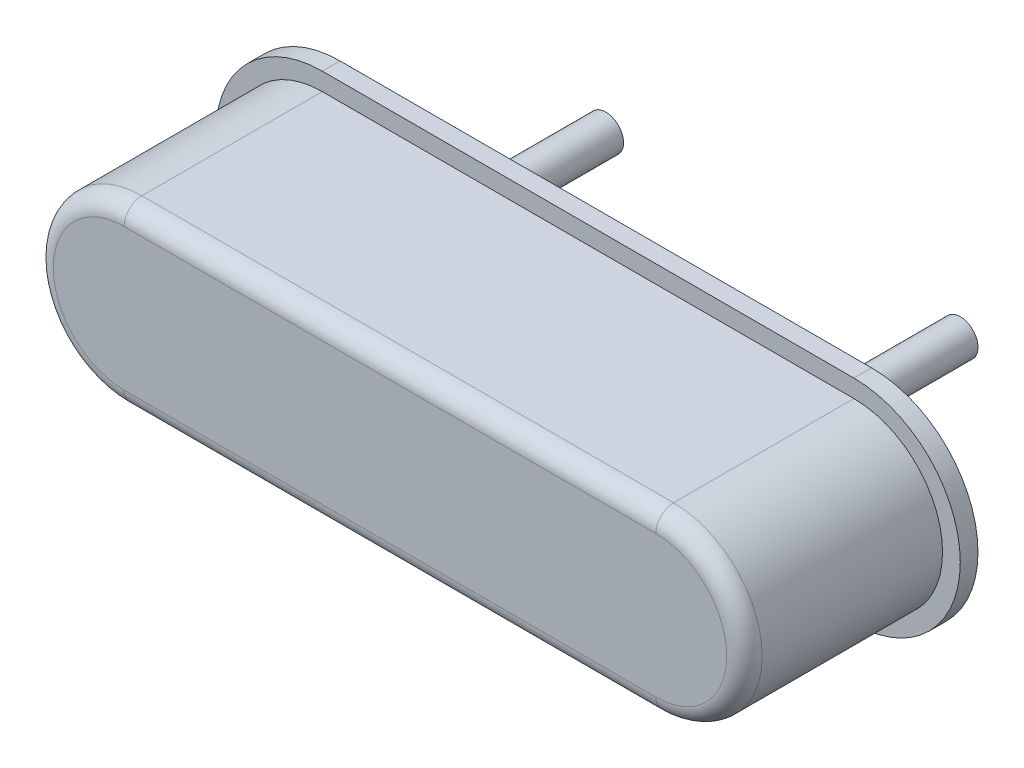
ISO-10303-21;
HEADER;
FILE_DESCRIPTION(('STEP AP214'),'2;1');
FILE_NAME('part.step','',(''),(''),'','','');
FILE_SCHEMA(('AUTOMOTIVE_DESIGN { 1 0 10303 214 1 1 1 1 }'));
ENDSEC;
DATA;
#1=APPLICATION_CONTEXT('core data for automotive mechanical design processes');
#2=APPLICATION_PROTOCOL_DEFINITION('international standard','automotive_design',2000,#1);
#3=PRODUCT_CONTEXT('',#1,'mechanical');
#4=PRODUCT('Part','Part','',(#3));
#5=PRODUCT_RELATED_PRODUCT_CATEGORY('part','',(#4));
#6=PRODUCT_DEFINITION_FORMATION('','',#4);
#7=PRODUCT_DEFINITION_CONTEXT('part definition',#1,'design');
#8=PRODUCT_DEFINITION('design','',#6,#7);
#9=PRODUCT_DEFINITION_SHAPE('','',#8);
#10=(LENGTH_UNIT() NAMED_UNIT(*) SI_UNIT(.MILLI.,.METRE.));
#11=(NAMED_UNIT(*) PLANE_ANGLE_UNIT() SI_UNIT($,.RADIAN.));
#12=(NAMED_UNIT(*) SI_UNIT($,.STERADIAN.) SOLID_ANGLE_UNIT());
#13=UNCERTAINTY_MEASURE_WITH_UNIT(LENGTH_MEASURE(1.E-05),#10,'distance_accuracy_value','');
#14=(GEOMETRIC_REPRESENTATION_CONTEXT(3) GLOBAL_UNCERTAINTY_ASSIGNED_CONTEXT((#13)) GLOBAL_UNIT_ASSIGNED_CONTEXT((#10,
#11,#12)) REPRESENTATION_CONTEXT('',''));
#15=CARTESIAN_POINT('',(0.,0.,0.));
#16=DIRECTION('',(0.,0.,1.));
#17=DIRECTION('',(1.,0.,0.));
#18=AXIS2_PLACEMENT_3D('',#15,#16,#17);
#19=CARTESIAN_POINT('',(7.62,1.27,3.09361477877701));
#20=DIRECTION('',(0.,0.,1.));
#21=DIRECTION('',(1.,0.,0.));
#22=AXIS2_PLACEMENT_3D('',#19,#20,#21);
#23=PLANE('',#22);
#24=DIRECTION('',(1.,0.,0.));
#25=VECTOR('',#24,1.);
#26=CARTESIAN_POINT('',(-2.54,-1.016,3.09361477877701));
#27=LINE('',#26,#25);
#28=CARTESIAN_POINT('',(6.35,-1.016,3.09361477877701));
#29=VERTEX_POINT('',#28);
#30=CARTESIAN_POINT('',(-1.27,-1.016,3.09361477877701));
#31=VERTEX_POINT('',#30);
#32=EDGE_CURVE('E175',#29,#31,#27,.F.);
#33=ORIENTED_EDGE('',*,*,#32,.F.);
#34=CARTESIAN_POINT('',(7.366,0.,3.09361477877701));
#35=CARTESIAN_POINT('',(7.3660003526422,-0.0166242779130649,3.09361477877701));
#36=CARTESIAN_POINT('',(7.36559199179916,-0.0332485258197346,3.09361477877701));
#37=CARTESIAN_POINT('',(7.36396037520976,-0.0664569884135803,3.09361477877701));
#38=CARTESIAN_POINT('',(7.36273711946339,-0.0830412031007561,3.09361477877701));
#39=CARTESIAN_POINT('',(7.35947824513451,-0.116129626048911,3.09361477877701));
#40=CARTESIAN_POINT('',(7.35744262655198,-0.132633834309891,3.09361477877701));
#41=CARTESIAN_POINT('',(7.35256404169645,-0.165522489783404,3.09361477877701));
#42=CARTESIAN_POINT('',(7.34972107542345,-0.181906936995939,3.09361477877701));
#43=CARTESIAN_POINT('',(7.34323461435591,-0.214516597340835,3.09361477877701));
#44=CARTESIAN_POINT('',(7.33959111956137,-0.230741810473197,3.09361477877701));
#45=CARTESIAN_POINT('',(7.33151238692994,-0.262993915090238,3.09361477877701));
#46=CARTESIAN_POINT('',(7.32707714909304,-0.279020806574916,3.09361477877701));
#47=CARTESIAN_POINT('',(7.3174256131148,-0.310837657606154,3.09361477877701));
#48=CARTESIAN_POINT('',(7.31220931497346,-0.326627617152714,3.09361477877701));
#49=CARTESIAN_POINT('',(7.30100822547844,-0.35793256494028,3.09361477877701));
#50=CARTESIAN_POINT('',(7.29502343412478,-0.373447553181286,3.09361477877701));
#51=CARTESIAN_POINT('',(7.28229977593816,-0.404165181384578,3.09361477877701));
#52=CARTESIAN_POINT('',(7.27556090910521,-0.419367821346863,3.09361477877701));
#53=CARTESIAN_POINT('',(7.26134533452163,-0.449424128503471,3.09361477877701));
#54=CARTESIAN_POINT('',(7.25386862677099,-0.464277795697793,3.09361477877701));
#55=CARTESIAN_POINT('',(7.23819538238487,-0.493600373532635,3.09361477877701));
#56=CARTESIAN_POINT('',(7.22999884574937,-0.508069284173154,3.09361477877701));
#57=CARTESIAN_POINT('',(7.21290568977118,-0.536587492027474,3.09361477877701));
#58=CARTESIAN_POINT('',(7.20400907042847,-0.550636789241274,3.09361477877701));
#59=CARTESIAN_POINT('',(7.1855371817703,-0.578281924254558,3.09361477877701));
#60=CARTESIAN_POINT('',(7.17596191245483,-0.59187776205404,3.09361477877701));
#61=CARTESIAN_POINT('',(7.15615579151383,-0.618583224674585,3.09361477877701));
#62=CARTESIAN_POINT('',(7.1459249398883,-0.631692849495647,3.09361477877701));
#63=CARTESIAN_POINT('',(7.12483230134478,-0.657394303924883,3.09361477877701));
#64=CARTESIAN_POINT('',(7.1139705144268,-0.669986133533058,3.09361477877701));
#65=CARTESIAN_POINT('',(7.09164217229447,-0.694621662716084,3.09361477877701));
#66=CARTESIAN_POINT('',(7.08017561708013,-0.706665362290935,3.09361477877701));
#67=CARTESIAN_POINT('',(7.05666536229093,-0.730175617080131,3.09361477877701));
#68=CARTESIAN_POINT('',(7.04462166271608,-0.741642172294476,3.09361477877701));
#69=CARTESIAN_POINT('',(7.01998613353306,-0.763970514426802,3.09361477877701));
#70=CARTESIAN_POINT('',(7.00739430392488,-0.774832301344783,3.09361477877701));
#71=CARTESIAN_POINT('',(6.98169284949564,-0.7959249398883,3.09361477877701));
#72=CARTESIAN_POINT('',(6.96858322467458,-0.806155791513836,3.09361477877701));
#73=CARTESIAN_POINT('',(6.94187776205404,-0.825961912454836,3.09361477877701));
#74=CARTESIAN_POINT('',(6.92828192425456,-0.835537181770301,3.09361477877701));
#75=CARTESIAN_POINT('',(6.90063678924127,-0.854009070428472,3.09361477877701));
#76=CARTESIAN_POINT('',(6.88658749202747,-0.862905689771178,3.09361477877701));
#77=CARTESIAN_POINT('',(6.85806928417315,-0.879998845749375,3.09361477877701));
#78=CARTESIAN_POINT('',(6.84360037353263,-0.888195382384866,3.09361477877701));
#79=CARTESIAN_POINT('',(6.81427779569779,-0.903868626770992,3.09361477877701));
#80=CARTESIAN_POINT('',(6.79942412850347,-0.911345334521627,3.09361477877701));
#81=CARTESIAN_POINT('',(6.76936782134686,-0.925560909105211,3.09361477877701));
#82=CARTESIAN_POINT('',(6.75416518138458,-0.93229977593816,3.09361477877701));
#83=CARTESIAN_POINT('',(6.72344755318128,-0.945023434124776,3.09361477877701));
#84=CARTESIAN_POINT('',(6.70793256494028,-0.951008225478442,3.09361477877701));
#85=CARTESIAN_POINT('',(6.67662761715271,-0.962209314973456,3.09361477877701));
#86=CARTESIAN_POINT('',(6.66083765760615,-0.967425613114804,3.09361477877701));
#87=CARTESIAN_POINT('',(6.62902080657491,-0.977077149093046,3.09361477877701));
#88=CARTESIAN_POINT('',(6.61299391509024,-0.98151238692994,3.09361477877701));
#89=CARTESIAN_POINT('',(6.5807418104732,-0.989591119561374,3.09361477877701));
#90=CARTESIAN_POINT('',(6.56451659734083,-0.993234614355912,3.09361477877701));
#91=CARTESIAN_POINT('',(6.53190693699594,-0.999721075423452,3.09361477877701));
#92=CARTESIAN_POINT('',(6.5155224897834,-1.00256404169645,3.09361477877701));
#93=CARTESIAN_POINT('',(6.48263383430989,-1.00744262655198,3.09361477877701));
#94=CARTESIAN_POINT('',(6.46612962604891,-1.00947824513451,3.09361477877701));
#95=CARTESIAN_POINT('',(6.43304120310075,-1.01273711946339,3.09361477877701));
#96=CARTESIAN_POINT('',(6.41645698841358,-1.01396037520975,3.09361477877701));
#97=CARTESIAN_POINT('',(6.38324852581973,-1.01559199179915,3.09361477877701));
#98=CARTESIAN_POINT('',(6.36662427791306,-1.0160003526422,3.09361477877701));
#99=CARTESIAN_POINT('',(6.35,-1.016,3.09361477877701));
#100=B_SPLINE_CURVE_WITH_KNOTS('',3,(#34,#35,#36,#37,#38,#39,#40,#41,#42,#43,#44,#45,#46,#47,
#48,#49,#50,#51,#52,#53,#54,#55,#56,#57,#58,#59,#60,#61,#62,#63,#64,#65,#66,#67,#68,#69,#70,#71,
#72,#73,#74,#75,#76,#77,#78,#79,#80,#81,#82,#83,#84,#85,#86,#87,#88,#89,#90,#91,#92,#93,#94,#95,
#96,#97,#98,#99),.UNSPECIFIED.,.F.,.F.,(4,2,2,2,2,2,2,2,2,2,2,2,2,2,2,2,2,2,2,2,2,2,2,2,2,2,2,2,
2,2,2,2,4),(0.,0.0498677763585586,0.0997355527171153,0.149603329075673,0.199471105434232,
0.24933888179279,0.299206658151348,0.349074434509905,0.398942210868463,0.448809987227021,
0.498677763585578,0.548545539944136,0.598413316302693,0.648281092661251,0.69814886901981,
0.748016645378367,0.797884421736925,0.847752198095483,0.897619974454041,0.947487750812599,
0.997355527171155,1.04722330352971,1.09709107988827,1.14695885624683,1.19682663260539,
1.24669440896394,1.2965621853225,1.34642996168106,1.39629773803962,1.44616551439818,
1.49603329075673,1.54590106711529,1.59576884347385),.UNSPECIFIED.);
#101=CARTESIAN_POINT('',(7.366,0.,3.09361477877701));
#102=VERTEX_POINT('',#101);
#103=EDGE_CURVE('E188',#102,#29,#100,.T.);
#104=ORIENTED_EDGE('',*,*,#103,.F.);
#105=CARTESIAN_POINT('',(6.35,0.,3.09361477877701));
#106=DIRECTION('',(0.,0.,-1.));
#107=DIRECTION('',(0.,1.,0.));
#108=AXIS2_PLACEMENT_3D('',#105,#106,#107);
#109=CIRCLE('',#108,1.016);
#110=CARTESIAN_POINT('',(6.35,1.016,3.09361477877701));
#111=VERTEX_POINT('',#110);
#112=EDGE_CURVE('E132',#111,#102,#109,.T.);
#113=ORIENTED_EDGE('',*,*,#112,.F.);
#114=DIRECTION('',(-1.,0.,0.));
#115=VECTOR('',#114,1.);
#116=CARTESIAN_POINT('',(7.62,1.016,3.09361477877701));
#117=LINE('',#116,#115);
#118=CARTESIAN_POINT('',(-1.27,1.016,3.09361477877701));
#119=VERTEX_POINT('',#118);
#120=EDGE_CURVE('E130',#119,#111,#117,.F.);
#121=ORIENTED_EDGE('',*,*,#120,.F.);
#122=CARTESIAN_POINT('',(-1.27,0.,3.09361477877701));
#123=DIRECTION('',(0.,0.,-1.));
#124=DIRECTION('',(-1.,0.,0.));
#125=AXIS2_PLACEMENT_3D('',#122,#123,#124);
#126=CIRCLE('',#125,1.016);
#127=CARTESIAN_POINT('',(-2.286,0.,3.09361477877701));
#128=VERTEX_POINT('',#127);
#129=EDGE_CURVE('E115',#119,#128,#126,.F.);
#130=ORIENTED_EDGE('',*,*,#129,.T.);
#131=CARTESIAN_POINT('',(-1.27,0.,3.09361477877701));
#132=DIRECTION('',(0.,0.,-1.));
#133=DIRECTION('',(0.,-1.,0.));
#134=AXIS2_PLACEMENT_3D('',#131,#132,#133);
#135=CIRCLE('',#134,1.016);
#136=EDGE_CURVE('E125',#31,#128,#135,.T.);
#137=ORIENTED_EDGE('',*,*,#136,.F.);
#138=EDGE_LOOP('',(#33,#104,#113,#121,#130,#137));
#139=FACE_BOUND('',#138,.T.);
#140=ADVANCED_FACE('F16',(#139),#23,.T.);
#141=CARTESIAN_POINT('',(-2.54,-1.016,2.83961477877701));
#142=DIRECTION('',(1.,0.,0.));
#143=DIRECTION('',(0.,0.,-1.));
#144=AXIS2_PLACEMENT_3D('',#141,#142,#143);
#145=CYLINDRICAL_SURFACE('',#144,0.254);
#146=CARTESIAN_POINT('',(6.35,-1.016,2.83961477877701));
#147=DIRECTION('',(1.,0.,0.));
#148=DIRECTION('',(0.,-1.,0.));
#149=AXIS2_PLACEMENT_3D('',#146,#147,#148);
#150=CIRCLE('',#149,0.254);
#151=CARTESIAN_POINT('',(6.35,-1.27,2.83961477877701));
#152=VERTEX_POINT('',#151);
#153=EDGE_CURVE('E159',#29,#152,#150,.T.);
#154=ORIENTED_EDGE('',*,*,#153,.F.);
#155=ORIENTED_EDGE('',*,*,#32,.T.);
#156=CARTESIAN_POINT('',(-1.27,-1.016,2.83961477877701));
#157=DIRECTION('',(1.,0.,0.));
#158=DIRECTION('',(0.,0.,-1.));
#159=AXIS2_PLACEMENT_3D('',#156,#157,#158);
#160=CIRCLE('',#159,0.254);
#161=CARTESIAN_POINT('',(-1.27,-1.27,2.83961477877701));
#162=VERTEX_POINT('',#161);
#163=EDGE_CURVE('E182',#31,#162,#160,.T.);
#164=ORIENTED_EDGE('',*,*,#163,.T.);
#165=DIRECTION('',(1.,0.,0.));
#166=VECTOR('',#165,1.);
#167=CARTESIAN_POINT('',(-2.54,-1.27,2.83961477877701));
#168=LINE('',#167,#166);
#169=EDGE_CURVE('E140',#162,#152,#168,.T.);
#170=ORIENTED_EDGE('',*,*,#169,.T.);
#171=EDGE_LOOP('',(#154,#155,#164,#170));
#172=FACE_BOUND('',#171,.T.);
#173=ADVANCED_FACE('F165',(#172),#145,.T.);
#174=CARTESIAN_POINT('',(6.35,0.,2.83961477877701));
#175=DIRECTION('',(0.,0.,1.));
#176=DIRECTION('',(1.,0.,0.));
#177=AXIS2_PLACEMENT_3D('',#174,#175,#176);
#178=TOROIDAL_SURFACE('',#177,1.016,0.254);
#179=CARTESIAN_POINT('',(6.35,1.016,2.83961477877701));
#180=DIRECTION('',(-1.,0.,0.));
#181=DIRECTION('',(0.,0.,1.));
#182=AXIS2_PLACEMENT_3D('',#179,#180,#181);
#183=CIRCLE('',#182,0.254);
#184=CARTESIAN_POINT('',(6.35,1.27,2.83961477877701));
#185=VERTEX_POINT('',#184);
#186=EDGE_CURVE('E135',#111,#185,#183,.T.);
#187=ORIENTED_EDGE('',*,*,#186,.F.);
#188=ORIENTED_EDGE('',*,*,#112,.T.);
#189=ORIENTED_EDGE('',*,*,#103,.T.);
#190=ORIENTED_EDGE('',*,*,#153,.T.);
#191=CARTESIAN_POINT('',(6.35,0.,2.83961477877701));
#192=DIRECTION('',(0.,0.,1.));
#193=DIRECTION('',(1.,0.,0.));
#194=AXIS2_PLACEMENT_3D('',#191,#192,#193);
#195=CIRCLE('',#194,1.27);
#196=EDGE_CURVE('E151',#185,#152,#195,.F.);
#197=ORIENTED_EDGE('',*,*,#196,.F.);
#198=EDGE_LOOP('',(#187,#188,#189,#190,#197));
#199=FACE_BOUND('',#198,.T.);
#200=ADVANCED_FACE('F161',(#199),#178,.T.);
#201=CARTESIAN_POINT('',(7.62,1.016,2.83961477877701));
#202=DIRECTION('',(-1.,0.,0.));
#203=DIRECTION('',(0.,0.,1.));
#204=AXIS2_PLACEMENT_3D('',#201,#202,#203);
#205=CYLINDRICAL_SURFACE('',#204,0.254);
#206=CARTESIAN_POINT('',(-1.27,1.016,2.83961477877701));
#207=DIRECTION('',(-1.,0.,0.));
#208=DIRECTION('',(0.,1.,0.));
#209=AXIS2_PLACEMENT_3D('',#206,#207,#208);
#210=CIRCLE('',#209,0.254);
#211=CARTESIAN_POINT('',(-1.27,1.27,2.83961477877701));
#212=VERTEX_POINT('',#211);
#213=EDGE_CURVE('E122',#119,#212,#210,.T.);
#214=ORIENTED_EDGE('',*,*,#213,.F.);
#215=ORIENTED_EDGE('',*,*,#120,.T.);
#216=ORIENTED_EDGE('',*,*,#186,.T.);
#217=DIRECTION('',(1.,0.,0.));
#218=VECTOR('',#217,1.);
#219=CARTESIAN_POINT('',(-2.54,1.27,2.83961477877701));
#220=LINE('',#219,#218);
#221=EDGE_CURVE('E88',#212,#185,#220,.T.);
#222=ORIENTED_EDGE('',*,*,#221,.F.);
#223=EDGE_LOOP('',(#214,#215,#216,#222));
#224=FACE_BOUND('',#223,.T.);
#225=ADVANCED_FACE('F137',(#224),#205,.T.);
#226=CARTESIAN_POINT('',(-1.27,0.,2.83961477877701));
#227=DIRECTION('',(0.,0.,1.));
#228=DIRECTION('',(1.,0.,0.));
#229=AXIS2_PLACEMENT_3D('',#226,#227,#228);
#230=TOROIDAL_SURFACE('',#229,1.016,0.254);
#231=ORIENTED_EDGE('',*,*,#213,.T.);
#232=CARTESIAN_POINT('',(-1.27,0.,2.83961477877701));
#233=DIRECTION('',(0.,0.,-1.));
#234=DIRECTION('',(-1.,0.,0.));
#235=AXIS2_PLACEMENT_3D('',#232,#233,#234);
#236=CIRCLE('',#235,1.27);
#237=EDGE_CURVE('E238',#162,#212,#236,.T.);
#238=ORIENTED_EDGE('',*,*,#237,.F.);
#239=ORIENTED_EDGE('',*,*,#163,.F.);
#240=ORIENTED_EDGE('',*,*,#136,.T.);
#241=ORIENTED_EDGE('',*,*,#129,.F.);
#242=EDGE_LOOP('',(#231,#238,#239,#240,#241));
#243=FACE_BOUND('',#242,.T.);
#244=ADVANCED_FACE('F121',(#243),#230,.T.);
#245=CARTESIAN_POINT('',(-2.54,-1.27,0.));
#246=DIRECTION('',(0.,1.,0.));
#247=DIRECTION('',(0.,0.,1.));
#248=AXIS2_PLACEMENT_3D('',#245,#246,#247);
#249=PLANE('',#248);
#250=DIRECTION('',(0.,0.,-1.));
#251=VECTOR('',#250,1.);
#252=CARTESIAN_POINT('',(6.35,-1.27,3.09361477877701));
#253=LINE('',#252,#251);
#254=CARTESIAN_POINT('',(6.35,-1.27,0.254));
#255=VERTEX_POINT('',#254);
#256=EDGE_CURVE('E154',#152,#255,#253,.T.);
#257=ORIENTED_EDGE('',*,*,#256,.F.);
#258=ORIENTED_EDGE('',*,*,#169,.F.);
#259=DIRECTION('',(0.,0.,1.));
#260=VECTOR('',#259,1.);
#261=CARTESIAN_POINT('',(-1.27,-1.27,0.));
#262=LINE('',#261,#260);
#263=CARTESIAN_POINT('',(-1.27,-1.27,0.254));
#264=VERTEX_POINT('',#263);
#265=EDGE_CURVE('E138',#264,#162,#262,.T.);
#266=ORIENTED_EDGE('',*,*,#265,.F.);
#267=DIRECTION('',(-1.,0.,0.));
#268=VECTOR('',#267,1.);
#269=CARTESIAN_POINT('',(6.35,-1.27,0.254));
#270=LINE('',#269,#268);
#271=EDGE_CURVE('E245',#264,#255,#270,.F.);
#272=ORIENTED_EDGE('',*,*,#271,.T.);
#273=EDGE_LOOP('',(#257,#258,#266,#272));
#274=FACE_BOUND('',#273,.T.);
#275=ADVANCED_FACE('F252',(#274),#249,.F.);
#276=CARTESIAN_POINT('',(6.35,0.,0.));
#277=DIRECTION('',(0.,0.,1.));
#278=DIRECTION('',(1.,0.,0.));
#279=AXIS2_PLACEMENT_3D('',#276,#277,#278);
#280=CYLINDRICAL_SURFACE('',#279,1.27);
#281=DIRECTION('',(0.,0.,1.));
#282=VECTOR('',#281,1.);
#283=CARTESIAN_POINT('',(6.35,1.27,0.));
#284=LINE('',#283,#282);
#285=CARTESIAN_POINT('',(6.35,1.27,0.254));
#286=VERTEX_POINT('',#285);
#287=EDGE_CURVE('E153',#185,#286,#284,.F.);
#288=ORIENTED_EDGE('',*,*,#287,.F.);
#289=ORIENTED_EDGE('',*,*,#196,.T.);
#290=ORIENTED_EDGE('',*,*,#256,.T.);
#291=CARTESIAN_POINT('',(6.35,0.,0.254));
#292=DIRECTION('',(0.,0.,1.));
#293=DIRECTION('',(1.,0.,0.));
#294=AXIS2_PLACEMENT_3D('',#291,#292,#293);
#295=CIRCLE('',#294,1.27);
#296=EDGE_CURVE('E71',#255,#286,#295,.T.);
#297=ORIENTED_EDGE('',*,*,#296,.T.);
#298=EDGE_LOOP('',(#288,#289,#290,#297));
#299=FACE_BOUND('',#298,.T.);
#300=ADVANCED_FACE('F336',(#299),#280,.T.);
#301=CARTESIAN_POINT('',(-2.54,1.27,0.));
#302=DIRECTION('',(0.,1.,0.));
#303=DIRECTION('',(0.,0.,1.));
#304=AXIS2_PLACEMENT_3D('',#301,#302,#303);
#305=PLANE('',#304);
#306=DIRECTION('',(0.,0.,-1.));
#307=VECTOR('',#306,1.);
#308=CARTESIAN_POINT('',(-1.27,1.27,0.));
#309=LINE('',#308,#307);
#310=CARTESIAN_POINT('',(-1.27,1.27,0.254));
#311=VERTEX_POINT('',#310);
#312=EDGE_CURVE('E237',#212,#311,#309,.T.);
#313=ORIENTED_EDGE('',*,*,#312,.F.);
#314=ORIENTED_EDGE('',*,*,#221,.T.);
#315=ORIENTED_EDGE('',*,*,#287,.T.);
#316=DIRECTION('',(-1.,0.,0.));
#317=VECTOR('',#316,1.);
#318=CARTESIAN_POINT('',(6.35,1.27,0.254));
#319=LINE('',#318,#317);
#320=EDGE_CURVE('E268',#286,#311,#319,.T.);
#321=ORIENTED_EDGE('',*,*,#320,.T.);
#322=EDGE_LOOP('',(#313,#314,#315,#321));
#323=FACE_BOUND('',#322,.T.);
#324=ADVANCED_FACE('F236',(#323),#305,.T.);
#325=CARTESIAN_POINT('',(-1.27,0.,0.));
#326=DIRECTION('',(0.,0.,-1.));
#327=DIRECTION('',(-1.,0.,0.));
#328=AXIS2_PLACEMENT_3D('',#325,#326,#327);
#329=CYLINDRICAL_SURFACE('',#328,1.27);
#330=CARTESIAN_POINT('',(-1.27,0.,0.254));
#331=DIRECTION('',(0.,0.,-1.));
#332=DIRECTION('',(-1.,0.,0.));
#333=AXIS2_PLACEMENT_3D('',#330,#331,#332);
#334=CIRCLE('',#333,1.27);
#335=EDGE_CURVE('E79',#311,#264,#334,.F.);
#336=ORIENTED_EDGE('',*,*,#335,.T.);
#337=ORIENTED_EDGE('',*,*,#265,.T.);
#338=ORIENTED_EDGE('',*,*,#237,.T.);
#339=ORIENTED_EDGE('',*,*,#312,.T.);
#340=EDGE_LOOP('',(#336,#337,#338,#339));
#341=FACE_BOUND('',#340,.T.);
#342=ADVANCED_FACE('F324',(#341),#329,.T.);
#343=CARTESIAN_POINT('',(0.,0.,-2.54));
#344=DIRECTION('',(0.,0.,1.));
#345=DIRECTION('',(1.,0.,0.));
#346=AXIS2_PLACEMENT_3D('',#343,#344,#345);
#347=PLANE('',#346);
#348=CARTESIAN_POINT('',(0.,0.,-2.54));
#349=DIRECTION('',(0.,0.,-1.));
#350=DIRECTION('',(-1.,0.,0.));
#351=AXIS2_PLACEMENT_3D('',#348,#349,#350);
#352=CIRCLE('',#351,0.254);
#353=CARTESIAN_POINT('',(-0.254,0.,-2.54));
#354=VERTEX_POINT('',#353);
#355=EDGE_CURVE('E270',#354,#354,#352,.F.);
#356=ORIENTED_EDGE('',*,*,#355,.F.);
#357=EDGE_LOOP('',(#356));
#358=FACE_BOUND('',#357,.T.);
#359=ADVANCED_FACE('F326',(#358),#347,.F.);
#360=CARTESIAN_POINT('',(5.08,0.,-2.54));
#361=DIRECTION('',(0.,0.,1.));
#362=DIRECTION('',(1.,0.,0.));
#363=AXIS2_PLACEMENT_3D('',#360,#361,#362);
#364=PLANE('',#363);
#365=CARTESIAN_POINT('',(5.08,0.,-2.54));
#366=DIRECTION('',(0.,0.,-1.));
#367=DIRECTION('',(-1.,0.,0.));
#368=AXIS2_PLACEMENT_3D('',#365,#366,#367);
#369=CIRCLE('',#368,0.254);
#370=CARTESIAN_POINT('',(4.826,0.,-2.54));
#371=VERTEX_POINT('',#370);
#372=EDGE_CURVE('E273',#371,#371,#369,.F.);
#373=ORIENTED_EDGE('',*,*,#372,.F.);
#374=EDGE_LOOP('',(#373));
#375=FACE_BOUND('',#374,.T.);
#376=ADVANCED_FACE('F333',(#375),#364,.F.);
#377=CARTESIAN_POINT('',(6.35,0.,0.254));
#378=DIRECTION('',(0.,0.,-1.));
#379=DIRECTION('',(-1.,0.,0.));
#380=AXIS2_PLACEMENT_3D('',#377,#378,#379);
#381=PLANE('',#380);
#382=DIRECTION('',(1.,0.,0.));
#383=VECTOR('',#382,1.);
#384=CARTESIAN_POINT('',(-1.27,1.524,0.254));
#385=LINE('',#384,#383);
#386=CARTESIAN_POINT('',(-1.27,1.524,0.254));
#387=VERTEX_POINT('',#386);
#388=CARTESIAN_POINT('',(6.35,1.524,0.254));
#389=VERTEX_POINT('',#388);
#390=EDGE_CURVE('E298',#387,#389,#385,.T.);
#391=ORIENTED_EDGE('',*,*,#390,.F.);
#392=CARTESIAN_POINT('',(-1.27,0.,0.254));
#393=DIRECTION('',(0.,0.,-1.));
#394=DIRECTION('',(-1.,0.,0.));
#395=AXIS2_PLACEMENT_3D('',#392,#393,#394);
#396=CIRCLE('',#395,1.524);
#397=CARTESIAN_POINT('',(-1.27,-1.524,0.254));
#398=VERTEX_POINT('',#397);
#399=EDGE_CURVE('E279',#398,#387,#396,.T.);
#400=ORIENTED_EDGE('',*,*,#399,.F.);
#401=DIRECTION('',(1.,0.,0.));
#402=VECTOR('',#401,1.);
#403=CARTESIAN_POINT('',(6.35,-1.524,0.254));
#404=LINE('',#403,#402);
#405=CARTESIAN_POINT('',(6.35,-1.524,0.254));
#406=VERTEX_POINT('',#405);
#407=EDGE_CURVE('E303',#406,#398,#404,.F.);
#408=ORIENTED_EDGE('',*,*,#407,.F.);
#409=CARTESIAN_POINT('',(6.35,0.,0.254));
#410=DIRECTION('',(0.,0.,-1.));
#411=DIRECTION('',(-1.,0.,0.));
#412=AXIS2_PLACEMENT_3D('',#409,#410,#411);
#413=CIRCLE('',#412,1.524);
#414=EDGE_CURVE('E276',#389,#406,#413,.T.);
#415=ORIENTED_EDGE('',*,*,#414,.F.);
#416=EDGE_LOOP('',(#391,#400,#408,#415));
#417=FACE_BOUND('',#416,.T.);
#418=ORIENTED_EDGE('',*,*,#320,.F.);
#419=ORIENTED_EDGE('',*,*,#296,.F.);
#420=ORIENTED_EDGE('',*,*,#271,.F.);
#421=ORIENTED_EDGE('',*,*,#335,.F.);
#422=EDGE_LOOP('',(#418,#419,#420,#421));
#423=FACE_BOUND('',#422,.T.);
#424=ADVANCED_FACE('F323',(#417,#423),#381,.F.);
#425=CARTESIAN_POINT('',(0.,0.,0.508));
#426=DIRECTION('',(0.,0.,-1.));
#427=DIRECTION('',(-1.,0.,0.));
#428=AXIS2_PLACEMENT_3D('',#425,#426,#427);
#429=CYLINDRICAL_SURFACE('',#428,0.254);
#430=CARTESIAN_POINT('',(0.,0.,0.));
#431=DIRECTION('',(0.,0.,-1.));
#432=DIRECTION('',(-1.,0.,0.));
#433=AXIS2_PLACEMENT_3D('',#430,#431,#432);
#434=CIRCLE('',#433,0.254);
#435=CARTESIAN_POINT('',(-0.254,0.,0.));
#436=VERTEX_POINT('',#435);
#437=EDGE_CURVE('E283',#436,#436,#434,.F.);
#438=ORIENTED_EDGE('',*,*,#437,.F.);
#439=EDGE_LOOP('',(#438));
#440=FACE_BOUND('',#439,.T.);
#441=ORIENTED_EDGE('',*,*,#355,.T.);
#442=EDGE_LOOP('',(#441));
#443=FACE_BOUND('',#442,.T.);
#444=ADVANCED_FACE('F364',(#440,#443),#429,.T.);
#445=CARTESIAN_POINT('',(5.08,0.,0.508));
#446=DIRECTION('',(0.,0.,-1.));
#447=DIRECTION('',(-1.,0.,0.));
#448=AXIS2_PLACEMENT_3D('',#445,#446,#447);
#449=CYLINDRICAL_SURFACE('',#448,0.254);
#450=ORIENTED_EDGE('',*,*,#372,.T.);
#451=EDGE_LOOP('',(#450));
#452=FACE_BOUND('',#451,.T.);
#453=CARTESIAN_POINT('',(5.08,0.,0.));
#454=DIRECTION('',(0.,0.,-1.));
#455=DIRECTION('',(-1.,0.,0.));
#456=AXIS2_PLACEMENT_3D('',#453,#454,#455);
#457=CIRCLE('',#456,0.254);
#458=CARTESIAN_POINT('',(4.826,0.,0.));
#459=VERTEX_POINT('',#458);
#460=EDGE_CURVE('E286',#459,#459,#457,.F.);
#461=ORIENTED_EDGE('',*,*,#460,.F.);
#462=EDGE_LOOP('',(#461));
#463=FACE_BOUND('',#462,.T.);
#464=ADVANCED_FACE('F360',(#452,#463),#449,.T.);
#465=CARTESIAN_POINT('',(6.35,0.,0.254));
#466=DIRECTION('',(0.,0.,-1.));
#467=DIRECTION('',(-1.,0.,0.));
#468=AXIS2_PLACEMENT_3D('',#465,#466,#467);
#469=CYLINDRICAL_SURFACE('',#468,1.524);
#470=ORIENTED_EDGE('',*,*,#414,.T.);
#471=DIRECTION('',(0.,0.,-1.));
#472=VECTOR('',#471,1.);
#473=CARTESIAN_POINT('',(6.35,-1.524,0.254));
#474=LINE('',#473,#472);
#475=CARTESIAN_POINT('',(6.35,-1.524,0.));
#476=VERTEX_POINT('',#475);
#477=EDGE_CURVE('E278',#476,#406,#474,.F.);
#478=ORIENTED_EDGE('',*,*,#477,.F.);
#479=CARTESIAN_POINT('',(6.35,0.,0.));
#480=DIRECTION('',(0.,0.,-1.));
#481=DIRECTION('',(-1.,0.,0.));
#482=AXIS2_PLACEMENT_3D('',#479,#480,#481);
#483=CIRCLE('',#482,1.524);
#484=CARTESIAN_POINT('',(6.35,1.524,0.));
#485=VERTEX_POINT('',#484);
#486=EDGE_CURVE('E290',#485,#476,#483,.T.);
#487=ORIENTED_EDGE('',*,*,#486,.F.);
#488=DIRECTION('',(0.,0.,1.));
#489=VECTOR('',#488,1.);
#490=CARTESIAN_POINT('',(6.35,1.524,0.254));
#491=LINE('',#490,#489);
#492=EDGE_CURVE('E287',#389,#485,#491,.F.);
#493=ORIENTED_EDGE('',*,*,#492,.F.);
#494=EDGE_LOOP('',(#470,#478,#487,#493));
#495=FACE_BOUND('',#494,.T.);
#496=ADVANCED_FACE('F356',(#495),#469,.T.);
#497=CARTESIAN_POINT('',(6.35,-1.524,0.254));
#498=DIRECTION('',(0.,-1.,0.));
#499=DIRECTION('',(0.,0.,-1.));
#500=AXIS2_PLACEMENT_3D('',#497,#498,#499);
#501=PLANE('',#500);
#502=ORIENTED_EDGE('',*,*,#407,.T.);
#503=DIRECTION('',(0.,0.,-1.));
#504=VECTOR('',#503,1.);
#505=CARTESIAN_POINT('',(-1.27,-1.524,0.254));
#506=LINE('',#505,#504);
#507=CARTESIAN_POINT('',(-1.27,-1.524,0.));
#508=VERTEX_POINT('',#507);
#509=EDGE_CURVE('E282',#508,#398,#506,.F.);
#510=ORIENTED_EDGE('',*,*,#509,.F.);
#511=DIRECTION('',(-1.,0.,0.));
#512=VECTOR('',#511,1.);
#513=CARTESIAN_POINT('',(-2.54,-1.524,0.));
#514=LINE('',#513,#512);
#515=EDGE_CURVE('E292',#476,#508,#514,.T.);
#516=ORIENTED_EDGE('',*,*,#515,.F.);
#517=ORIENTED_EDGE('',*,*,#477,.T.);
#518=EDGE_LOOP('',(#502,#510,#516,#517));
#519=FACE_BOUND('',#518,.T.);
#520=ADVANCED_FACE('F352',(#519),#501,.T.);
#521=CARTESIAN_POINT('',(-1.27,0.,0.254));
#522=DIRECTION('',(0.,0.,-1.));
#523=DIRECTION('',(-1.,0.,0.));
#524=AXIS2_PLACEMENT_3D('',#521,#522,#523);
#525=CYLINDRICAL_SURFACE('',#524,1.524);
#526=DIRECTION('',(0.,0.,1.));
#527=VECTOR('',#526,1.);
#528=CARTESIAN_POINT('',(-1.27,1.524,0.254));
#529=LINE('',#528,#527);
#530=CARTESIAN_POINT('',(-1.27,1.524,0.));
#531=VERTEX_POINT('',#530);
#532=EDGE_CURVE('E281',#531,#387,#529,.T.);
#533=ORIENTED_EDGE('',*,*,#532,.F.);
#534=CARTESIAN_POINT('',(-1.27,0.,0.));
#535=DIRECTION('',(0.,0.,-1.));
#536=DIRECTION('',(-1.,0.,0.));
#537=AXIS2_PLACEMENT_3D('',#534,#535,#536);
#538=CIRCLE('',#537,1.524);
#539=EDGE_CURVE('E28',#508,#531,#538,.T.);
#540=ORIENTED_EDGE('',*,*,#539,.F.);
#541=ORIENTED_EDGE('',*,*,#509,.T.);
#542=ORIENTED_EDGE('',*,*,#399,.T.);
#543=EDGE_LOOP('',(#533,#540,#541,#542));
#544=FACE_BOUND('',#543,.T.);
#545=ADVANCED_FACE('F345',(#544),#525,.T.);
#546=CARTESIAN_POINT('',(-1.27,1.524,0.254));
#547=DIRECTION('',(0.,1.,0.));
#548=DIRECTION('',(0.,0.,1.));
#549=AXIS2_PLACEMENT_3D('',#546,#547,#548);
#550=PLANE('',#549);
#551=ORIENTED_EDGE('',*,*,#390,.T.);
#552=ORIENTED_EDGE('',*,*,#492,.T.);
#553=DIRECTION('',(-1.,0.,0.));
#554=VECTOR('',#553,1.);
#555=CARTESIAN_POINT('',(-2.54,1.524,0.));
#556=LINE('',#555,#554);
#557=EDGE_CURVE('E11',#531,#485,#556,.F.);
#558=ORIENTED_EDGE('',*,*,#557,.F.);
#559=ORIENTED_EDGE('',*,*,#532,.T.);
#560=EDGE_LOOP('',(#551,#552,#558,#559));
#561=FACE_BOUND('',#560,.T.);
#562=ADVANCED_FACE('F340',(#561),#550,.T.);
#563=CARTESIAN_POINT('',(-2.54,1.27,0.));
#564=DIRECTION('',(0.,0.,-1.));
#565=DIRECTION('',(-1.,0.,0.));
#566=AXIS2_PLACEMENT_3D('',#563,#564,#565);
#567=PLANE('',#566);
#568=ORIENTED_EDGE('',*,*,#539,.T.);
#569=ORIENTED_EDGE('',*,*,#557,.T.);
#570=ORIENTED_EDGE('',*,*,#486,.T.);
#571=ORIENTED_EDGE('',*,*,#515,.T.);
#572=EDGE_LOOP('',(#568,#569,#570,#571));
#573=FACE_BOUND('',#572,.T.);
#574=ORIENTED_EDGE('',*,*,#460,.T.);
#575=EDGE_LOOP('',(#574));
#576=FACE_BOUND('',#575,.T.);
#577=ORIENTED_EDGE('',*,*,#437,.T.);
#578=EDGE_LOOP('',(#577));
#579=FACE_BOUND('',#578,.T.);
#580=ADVANCED_FACE('F338',(#573,#576,#579),#567,.T.);
#581=CLOSED_SHELL('',(#140,#173,#200,#225,#244,#275,#300,#324,#342,#359,#376,#424,#444,#464,
#496,#520,#545,#562,#580));
#582=MANIFOLD_SOLID_BREP('B1',#581);
#583=ADVANCED_BREP_SHAPE_REPRESENTATION('',(#18,#582),#14);
#584=SHAPE_DEFINITION_REPRESENTATION(#9,#583);
ENDSEC;
END-ISO-10303-21;
